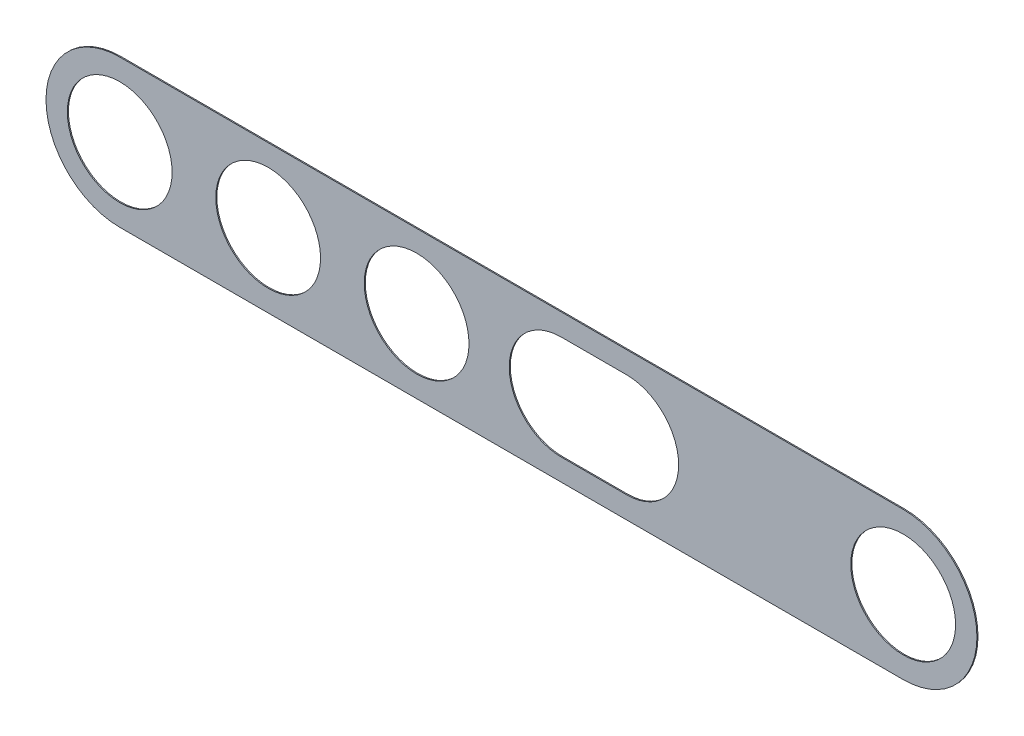
ISO-10303-21;
HEADER;
FILE_DESCRIPTION(('STEP AP214'),'2;1');
FILE_NAME('part.step','',(''),(''),'','','');
FILE_SCHEMA(('AUTOMOTIVE_DESIGN { 1 0 10303 214 1 1 1 1 }'));
ENDSEC;
DATA;
#1=APPLICATION_CONTEXT('core data for automotive mechanical design processes');
#2=APPLICATION_PROTOCOL_DEFINITION('international standard','automotive_design',2000,#1);
#3=PRODUCT_CONTEXT('',#1,'mechanical');
#4=PRODUCT('Part','Part','',(#3));
#5=PRODUCT_RELATED_PRODUCT_CATEGORY('part','',(#4));
#6=PRODUCT_DEFINITION_FORMATION('','',#4);
#7=PRODUCT_DEFINITION_CONTEXT('part definition',#1,'design');
#8=PRODUCT_DEFINITION('design','',#6,#7);
#9=PRODUCT_DEFINITION_SHAPE('','',#8);
#10=(LENGTH_UNIT() NAMED_UNIT(*) SI_UNIT(.MILLI.,.METRE.));
#11=(NAMED_UNIT(*) PLANE_ANGLE_UNIT() SI_UNIT($,.RADIAN.));
#12=(NAMED_UNIT(*) SI_UNIT($,.STERADIAN.) SOLID_ANGLE_UNIT());
#13=UNCERTAINTY_MEASURE_WITH_UNIT(LENGTH_MEASURE(1.E-05),#10,'distance_accuracy_value','');
#14=(GEOMETRIC_REPRESENTATION_CONTEXT(3) GLOBAL_UNCERTAINTY_ASSIGNED_CONTEXT((#13)) GLOBAL_UNIT_ASSIGNED_CONTEXT((#10,
#11,#12)) REPRESENTATION_CONTEXT('',''));
#15=CARTESIAN_POINT('',(0.,0.,0.));
#16=DIRECTION('',(0.,0.,1.));
#17=DIRECTION('',(1.,0.,0.));
#18=AXIS2_PLACEMENT_3D('',#15,#16,#17);
#19=CARTESIAN_POINT('',(13.96785551477,0.,-0.675));
#20=DIRECTION('',(0.,0.,1.));
#21=DIRECTION('',(1.,0.,0.));
#22=AXIS2_PLACEMENT_3D('',#19,#20,#21);
#23=CYLINDRICAL_SURFACE('',#22,6.3);
#24=DIRECTION('',(0.,0.,1.));
#25=VECTOR('',#24,1.);
#26=CARTESIAN_POINT('',(13.96785551477,6.3,-0.805));
#27=LINE('',#26,#25);
#28=CARTESIAN_POINT('',(13.96785551477,6.3,-0.805));
#29=VERTEX_POINT('',#28);
#30=CARTESIAN_POINT('',(13.96785551477,6.3,-0.675));
#31=VERTEX_POINT('',#30);
#32=EDGE_CURVE('E11',#29,#31,#27,.T.);
#33=ORIENTED_EDGE('',*,*,#32,.F.);
#34=CARTESIAN_POINT('',(13.96785551477,0.,-0.805));
#35=DIRECTION('',(0.,0.,-1.));
#36=DIRECTION('',(0.,1.,0.));
#37=AXIS2_PLACEMENT_3D('',#34,#35,#36);
#38=CIRCLE('',#37,6.3);
#39=CARTESIAN_POINT('',(20.26785551477,0.,-0.805));
#40=VERTEX_POINT('',#39);
#41=EDGE_CURVE('E237',#29,#40,#38,.T.);
#42=ORIENTED_EDGE('',*,*,#41,.T.);
#43=CARTESIAN_POINT('',(13.96785551477,0.,-0.805));
#44=DIRECTION('',(0.,0.,-1.));
#45=DIRECTION('',(1.,0.,0.));
#46=AXIS2_PLACEMENT_3D('',#43,#44,#45);
#47=CIRCLE('',#46,6.3);
#48=CARTESIAN_POINT('',(13.96785551477,-6.3,-0.805));
#49=VERTEX_POINT('',#48);
#50=EDGE_CURVE('E314',#40,#49,#47,.T.);
#51=ORIENTED_EDGE('',*,*,#50,.T.);
#52=DIRECTION('',(0.,0.,-1.));
#53=VECTOR('',#52,1.);
#54=CARTESIAN_POINT('',(13.96785551477,-6.3,-0.675));
#55=LINE('',#54,#53);
#56=CARTESIAN_POINT('',(13.96785551477,-6.3,-0.675));
#57=VERTEX_POINT('',#56);
#58=EDGE_CURVE('E296',#57,#49,#55,.T.);
#59=ORIENTED_EDGE('',*,*,#58,.F.);
#60=CARTESIAN_POINT('',(13.96785551477,0.,-0.675));
#61=DIRECTION('',(0.,0.,1.));
#62=DIRECTION('',(0.,-1.,0.));
#63=AXIS2_PLACEMENT_3D('',#60,#61,#62);
#64=CIRCLE('',#63,6.3);
#65=CARTESIAN_POINT('',(20.26785551477,0.,-0.675));
#66=VERTEX_POINT('',#65);
#67=EDGE_CURVE('E265',#57,#66,#64,.T.);
#68=ORIENTED_EDGE('',*,*,#67,.T.);
#69=CARTESIAN_POINT('',(13.96785551477,0.,-0.675));
#70=DIRECTION('',(0.,0.,1.));
#71=DIRECTION('',(1.,0.,0.));
#72=AXIS2_PLACEMENT_3D('',#69,#70,#71);
#73=CIRCLE('',#72,6.3);
#74=EDGE_CURVE('E262',#66,#31,#73,.T.);
#75=ORIENTED_EDGE('',*,*,#74,.T.);
#76=EDGE_LOOP('',(#33,#42,#51,#59,#68,#75));
#77=FACE_BOUND('',#76,.T.);
#78=ADVANCED_FACE('F17',(#77),#23,.F.);
#79=CARTESIAN_POINT('',(6.032144485231,6.3,-0.675));
#80=DIRECTION('',(0.,-1.,0.));
#81=DIRECTION('',(0.,0.,-1.));
#82=AXIS2_PLACEMENT_3D('',#79,#80,#81);
#83=PLANE('',#82);
#84=DIRECTION('',(0.,0.,-1.));
#85=VECTOR('',#84,1.);
#86=CARTESIAN_POINT('',(6.032144485231,6.3,-0.675));
#87=LINE('',#86,#85);
#88=CARTESIAN_POINT('',(6.032144485231,6.3,-0.675));
#89=VERTEX_POINT('',#88);
#90=CARTESIAN_POINT('',(6.032144485231,6.3,-0.805));
#91=VERTEX_POINT('',#90);
#92=EDGE_CURVE('E28',#89,#91,#87,.T.);
#93=ORIENTED_EDGE('',*,*,#92,.T.);
#94=DIRECTION('',(-1.,0.,0.));
#95=VECTOR('',#94,1.);
#96=CARTESIAN_POINT('',(13.96785551477,6.3,-0.805));
#97=LINE('',#96,#95);
#98=EDGE_CURVE('E244',#29,#91,#97,.T.);
#99=ORIENTED_EDGE('',*,*,#98,.F.);
#100=ORIENTED_EDGE('',*,*,#32,.T.);
#101=DIRECTION('',(-1.,0.,0.));
#102=VECTOR('',#101,1.);
#103=CARTESIAN_POINT('',(13.96785551477,6.3,-0.675));
#104=LINE('',#103,#102);
#105=EDGE_CURVE('E266',#31,#89,#104,.T.);
#106=ORIENTED_EDGE('',*,*,#105,.T.);
#107=EDGE_LOOP('',(#93,#99,#100,#106));
#108=FACE_BOUND('',#107,.T.);
#109=ADVANCED_FACE('F444',(#108),#83,.T.);
#110=CARTESIAN_POINT('',(6.032144485231,0.,-0.675));
#111=DIRECTION('',(0.,0.,1.));
#112=DIRECTION('',(1.,0.,0.));
#113=AXIS2_PLACEMENT_3D('',#110,#111,#112);
#114=CYLINDRICAL_SURFACE('',#113,6.3);
#115=DIRECTION('',(0.,0.,1.));
#116=VECTOR('',#115,1.);
#117=CARTESIAN_POINT('',(6.032144485231,-6.3,-0.805));
#118=LINE('',#117,#116);
#119=CARTESIAN_POINT('',(6.032144485231,-6.3,-0.805));
#120=VERTEX_POINT('',#119);
#121=CARTESIAN_POINT('',(6.032144485231,-6.3,-0.675));
#122=VERTEX_POINT('',#121);
#123=EDGE_CURVE('E42',#120,#122,#118,.T.);
#124=ORIENTED_EDGE('',*,*,#123,.F.);
#125=CARTESIAN_POINT('',(6.032144485231,0.,-0.805));
#126=DIRECTION('',(0.,0.,-1.));
#127=DIRECTION('',(0.,-1.,0.));
#128=AXIS2_PLACEMENT_3D('',#125,#126,#127);
#129=CIRCLE('',#128,6.3);
#130=CARTESIAN_POINT('',(-0.267855514769,0.,-0.805));
#131=VERTEX_POINT('',#130);
#132=EDGE_CURVE('E289',#120,#131,#129,.T.);
#133=ORIENTED_EDGE('',*,*,#132,.T.);
#134=CARTESIAN_POINT('',(6.032144485231,0.,-0.805));
#135=DIRECTION('',(0.,0.,-1.));
#136=DIRECTION('',(-1.,0.,0.));
#137=AXIS2_PLACEMENT_3D('',#134,#135,#136);
#138=CIRCLE('',#137,6.3);
#139=EDGE_CURVE('E21',#131,#91,#138,.T.);
#140=ORIENTED_EDGE('',*,*,#139,.T.);
#141=ORIENTED_EDGE('',*,*,#92,.F.);
#142=CARTESIAN_POINT('',(6.032144485231,0.,-0.675));
#143=DIRECTION('',(0.,0.,1.));
#144=DIRECTION('',(0.,1.,0.));
#145=AXIS2_PLACEMENT_3D('',#142,#143,#144);
#146=CIRCLE('',#145,6.3);
#147=CARTESIAN_POINT('',(-0.267855514769,0.,-0.675));
#148=VERTEX_POINT('',#147);
#149=EDGE_CURVE('E165',#89,#148,#146,.T.);
#150=ORIENTED_EDGE('',*,*,#149,.T.);
#151=CARTESIAN_POINT('',(6.032144485231,0.,-0.675));
#152=DIRECTION('',(0.,0.,1.));
#153=DIRECTION('',(-1.,0.,0.));
#154=AXIS2_PLACEMENT_3D('',#151,#152,#153);
#155=CIRCLE('',#154,6.3);
#156=EDGE_CURVE('E319',#148,#122,#155,.T.);
#157=ORIENTED_EDGE('',*,*,#156,.T.);
#158=EDGE_LOOP('',(#124,#133,#140,#141,#150,#157));
#159=FACE_BOUND('',#158,.T.);
#160=ADVANCED_FACE('F450',(#159),#114,.F.);
#161=CARTESIAN_POINT('',(13.96785551477,-6.3,-0.675));
#162=DIRECTION('',(0.,1.,0.));
#163=DIRECTION('',(1.,0.,0.));
#164=AXIS2_PLACEMENT_3D('',#161,#162,#163);
#165=PLANE('',#164);
#166=ORIENTED_EDGE('',*,*,#58,.T.);
#167=DIRECTION('',(1.,0.,0.));
#168=VECTOR('',#167,1.);
#169=CARTESIAN_POINT('',(6.032144485231,-6.3,-0.805));
#170=LINE('',#169,#168);
#171=EDGE_CURVE('E279',#120,#49,#170,.T.);
#172=ORIENTED_EDGE('',*,*,#171,.F.);
#173=ORIENTED_EDGE('',*,*,#123,.T.);
#174=DIRECTION('',(1.,0.,0.));
#175=VECTOR('',#174,1.);
#176=CARTESIAN_POINT('',(6.032144485231,-6.3,-0.675));
#177=LINE('',#176,#175);
#178=EDGE_CURVE('E380',#122,#57,#177,.T.);
#179=ORIENTED_EDGE('',*,*,#178,.T.);
#180=EDGE_LOOP('',(#166,#172,#173,#179));
#181=FACE_BOUND('',#180,.T.);
#182=ADVANCED_FACE('F19',(#181),#165,.T.);
#183=CARTESIAN_POINT('',(47.5,0.,-0.675));
#184=DIRECTION('',(0.,0.,1.));
#185=DIRECTION('',(1.,0.,0.));
#186=AXIS2_PLACEMENT_3D('',#183,#184,#185);
#187=CYLINDRICAL_SURFACE('',#186,6.35);
#188=DIRECTION('',(0.,0.,1.));
#189=VECTOR('',#188,1.);
#190=CARTESIAN_POINT('',(41.15,0.,-0.805));
#191=LINE('',#190,#189);
#192=CARTESIAN_POINT('',(41.15,0.,-0.805));
#193=VERTEX_POINT('',#192);
#194=CARTESIAN_POINT('',(41.15,0.,-0.675));
#195=VERTEX_POINT('',#194);
#196=EDGE_CURVE('E294',#193,#195,#191,.T.);
#197=ORIENTED_EDGE('',*,*,#196,.F.);
#198=CARTESIAN_POINT('',(47.5,0.,-0.805));
#199=DIRECTION('',(0.,0.,-1.));
#200=DIRECTION('',(-1.,0.,0.));
#201=AXIS2_PLACEMENT_3D('',#198,#199,#200);
#202=CIRCLE('',#201,6.35);
#203=CARTESIAN_POINT('',(53.85,0.,-0.805));
#204=VERTEX_POINT('',#203);
#205=EDGE_CURVE('E328',#193,#204,#202,.T.);
#206=ORIENTED_EDGE('',*,*,#205,.T.);
#207=DIRECTION('',(0.,0.,1.));
#208=VECTOR('',#207,1.);
#209=CARTESIAN_POINT('',(53.85,0.,-0.805));
#210=LINE('',#209,#208);
#211=CARTESIAN_POINT('',(53.85,0.,-0.675));
#212=VERTEX_POINT('',#211);
#213=EDGE_CURVE('E214',#204,#212,#210,.T.);
#214=ORIENTED_EDGE('',*,*,#213,.T.);
#215=CARTESIAN_POINT('',(47.5,0.,-0.675));
#216=DIRECTION('',(0.,0.,1.));
#217=DIRECTION('',(1.,0.,0.));
#218=AXIS2_PLACEMENT_3D('',#215,#216,#217);
#219=CIRCLE('',#218,6.35);
#220=EDGE_CURVE('E222',#212,#195,#219,.T.);
#221=ORIENTED_EDGE('',*,*,#220,.T.);
#222=EDGE_LOOP('',(#197,#206,#214,#221));
#223=FACE_BOUND('',#222,.T.);
#224=ADVANCED_FACE('F492',(#223),#187,.F.);
#225=CARTESIAN_POINT('',(47.5,0.,-0.675));
#226=DIRECTION('',(0.,0.,1.));
#227=DIRECTION('',(1.,0.,0.));
#228=AXIS2_PLACEMENT_3D('',#225,#226,#227);
#229=CYLINDRICAL_SURFACE('',#228,6.35);
#230=ORIENTED_EDGE('',*,*,#213,.F.);
#231=CARTESIAN_POINT('',(47.5,0.,-0.805));
#232=DIRECTION('',(0.,0.,-1.));
#233=DIRECTION('',(1.,0.,0.));
#234=AXIS2_PLACEMENT_3D('',#231,#232,#233);
#235=CIRCLE('',#234,6.35);
#236=EDGE_CURVE('E317',#204,#193,#235,.T.);
#237=ORIENTED_EDGE('',*,*,#236,.T.);
#238=ORIENTED_EDGE('',*,*,#196,.T.);
#239=CARTESIAN_POINT('',(47.5,0.,-0.675));
#240=DIRECTION('',(0.,0.,1.));
#241=DIRECTION('',(-1.,0.,0.));
#242=AXIS2_PLACEMENT_3D('',#239,#240,#241);
#243=CIRCLE('',#242,6.35);
#244=EDGE_CURVE('E322',#195,#212,#243,.T.);
#245=ORIENTED_EDGE('',*,*,#244,.T.);
#246=EDGE_LOOP('',(#230,#237,#238,#245));
#247=FACE_BOUND('',#246,.T.);
#248=ADVANCED_FACE('F490',(#247),#229,.F.);
#249=CARTESIAN_POINT('',(-47.5,0.,-0.675));
#250=DIRECTION('',(0.,0.,1.));
#251=DIRECTION('',(1.,0.,0.));
#252=AXIS2_PLACEMENT_3D('',#249,#250,#251);
#253=CYLINDRICAL_SURFACE('',#252,6.35);
#254=DIRECTION('',(0.,0.,1.));
#255=VECTOR('',#254,1.);
#256=CARTESIAN_POINT('',(-53.85,0.,-0.805));
#257=LINE('',#256,#255);
#258=CARTESIAN_POINT('',(-53.85,0.,-0.805));
#259=VERTEX_POINT('',#258);
#260=CARTESIAN_POINT('',(-53.85,0.,-0.675));
#261=VERTEX_POINT('',#260);
#262=EDGE_CURVE('E202',#259,#261,#257,.T.);
#263=ORIENTED_EDGE('',*,*,#262,.F.);
#264=CARTESIAN_POINT('',(-47.5,0.,-0.805));
#265=DIRECTION('',(0.,0.,-1.));
#266=DIRECTION('',(-1.,0.,0.));
#267=AXIS2_PLACEMENT_3D('',#264,#265,#266);
#268=CIRCLE('',#267,6.35);
#269=CARTESIAN_POINT('',(-41.15,0.,-0.805));
#270=VERTEX_POINT('',#269);
#271=EDGE_CURVE('E302',#259,#270,#268,.T.);
#272=ORIENTED_EDGE('',*,*,#271,.T.);
#273=DIRECTION('',(0.,0.,1.));
#274=VECTOR('',#273,1.);
#275=CARTESIAN_POINT('',(-41.15,0.,-0.805));
#276=LINE('',#275,#274);
#277=CARTESIAN_POINT('',(-41.15,0.,-0.675));
#278=VERTEX_POINT('',#277);
#279=EDGE_CURVE('E215',#270,#278,#276,.T.);
#280=ORIENTED_EDGE('',*,*,#279,.T.);
#281=CARTESIAN_POINT('',(-47.5,0.,-0.675));
#282=DIRECTION('',(0.,0.,1.));
#283=DIRECTION('',(1.,0.,0.));
#284=AXIS2_PLACEMENT_3D('',#281,#282,#283);
#285=CIRCLE('',#284,6.35);
#286=EDGE_CURVE('E220',#278,#261,#285,.T.);
#287=ORIENTED_EDGE('',*,*,#286,.T.);
#288=EDGE_LOOP('',(#263,#272,#280,#287));
#289=FACE_BOUND('',#288,.T.);
#290=ADVANCED_FACE('F224',(#289),#253,.F.);
#291=CARTESIAN_POINT('',(-47.5,0.,-0.675));
#292=DIRECTION('',(0.,0.,1.));
#293=DIRECTION('',(1.,0.,0.));
#294=AXIS2_PLACEMENT_3D('',#291,#292,#293);
#295=CYLINDRICAL_SURFACE('',#294,6.35);
#296=ORIENTED_EDGE('',*,*,#279,.F.);
#297=CARTESIAN_POINT('',(-47.5,0.,-0.805));
#298=DIRECTION('',(0.,0.,-1.));
#299=DIRECTION('',(1.,0.,0.));
#300=AXIS2_PLACEMENT_3D('',#297,#298,#299);
#301=CIRCLE('',#300,6.35);
#302=EDGE_CURVE('E208',#270,#259,#301,.T.);
#303=ORIENTED_EDGE('',*,*,#302,.T.);
#304=ORIENTED_EDGE('',*,*,#262,.T.);
#305=CARTESIAN_POINT('',(-47.5,0.,-0.675));
#306=DIRECTION('',(0.,0.,1.));
#307=DIRECTION('',(-1.,0.,0.));
#308=AXIS2_PLACEMENT_3D('',#305,#306,#307);
#309=CIRCLE('',#308,6.35);
#310=EDGE_CURVE('E205',#261,#278,#309,.T.);
#311=ORIENTED_EDGE('',*,*,#310,.T.);
#312=EDGE_LOOP('',(#296,#303,#304,#311));
#313=FACE_BOUND('',#312,.T.);
#314=ADVANCED_FACE('F204',(#313),#295,.F.);
#315=CARTESIAN_POINT('',(-29.5,0.,-0.675));
#316=DIRECTION('',(0.,0.,1.));
#317=DIRECTION('',(1.,0.,0.));
#318=AXIS2_PLACEMENT_3D('',#315,#316,#317);
#319=CYLINDRICAL_SURFACE('',#318,6.35);
#320=DIRECTION('',(0.,0.,1.));
#321=VECTOR('',#320,1.);
#322=CARTESIAN_POINT('',(-35.85,0.,-0.805));
#323=LINE('',#322,#321);
#324=CARTESIAN_POINT('',(-35.85,0.,-0.805));
#325=VERTEX_POINT('',#324);
#326=CARTESIAN_POINT('',(-35.85,0.,-0.675));
#327=VERTEX_POINT('',#326);
#328=EDGE_CURVE('E258',#325,#327,#323,.T.);
#329=ORIENTED_EDGE('',*,*,#328,.F.);
#330=CARTESIAN_POINT('',(-29.5,0.,-0.805));
#331=DIRECTION('',(0.,0.,-1.));
#332=DIRECTION('',(-1.,0.,0.));
#333=AXIS2_PLACEMENT_3D('',#330,#331,#332);
#334=CIRCLE('',#333,6.35);
#335=CARTESIAN_POINT('',(-23.15,0.,-0.805));
#336=VERTEX_POINT('',#335);
#337=EDGE_CURVE('E369',#325,#336,#334,.T.);
#338=ORIENTED_EDGE('',*,*,#337,.T.);
#339=DIRECTION('',(0.,0.,1.));
#340=VECTOR('',#339,1.);
#341=CARTESIAN_POINT('',(-23.15,0.,-0.805));
#342=LINE('',#341,#340);
#343=CARTESIAN_POINT('',(-23.15,0.,-0.675));
#344=VERTEX_POINT('',#343);
#345=EDGE_CURVE('E261',#336,#344,#342,.T.);
#346=ORIENTED_EDGE('',*,*,#345,.T.);
#347=CARTESIAN_POINT('',(-29.5,0.,-0.675));
#348=DIRECTION('',(0.,0.,1.));
#349=DIRECTION('',(1.,0.,0.));
#350=AXIS2_PLACEMENT_3D('',#347,#348,#349);
#351=CIRCLE('',#350,6.35);
#352=EDGE_CURVE('E233',#344,#327,#351,.T.);
#353=ORIENTED_EDGE('',*,*,#352,.T.);
#354=EDGE_LOOP('',(#329,#338,#346,#353));
#355=FACE_BOUND('',#354,.T.);
#356=ADVANCED_FACE('F458',(#355),#319,.F.);
#357=CARTESIAN_POINT('',(-29.5,0.,-0.675));
#358=DIRECTION('',(0.,0.,1.));
#359=DIRECTION('',(1.,0.,0.));
#360=AXIS2_PLACEMENT_3D('',#357,#358,#359);
#361=CYLINDRICAL_SURFACE('',#360,6.35);
#362=ORIENTED_EDGE('',*,*,#345,.F.);
#363=CARTESIAN_POINT('',(-29.5,0.,-0.805));
#364=DIRECTION('',(0.,0.,-1.));
#365=DIRECTION('',(1.,0.,0.));
#366=AXIS2_PLACEMENT_3D('',#363,#364,#365);
#367=CIRCLE('',#366,6.35);
#368=EDGE_CURVE('E305',#336,#325,#367,.T.);
#369=ORIENTED_EDGE('',*,*,#368,.T.);
#370=ORIENTED_EDGE('',*,*,#328,.T.);
#371=CARTESIAN_POINT('',(-29.5,0.,-0.675));
#372=DIRECTION('',(0.,0.,1.));
#373=DIRECTION('',(-1.,0.,0.));
#374=AXIS2_PLACEMENT_3D('',#371,#372,#373);
#375=CIRCLE('',#374,6.35);
#376=EDGE_CURVE('E226',#327,#344,#375,.T.);
#377=ORIENTED_EDGE('',*,*,#376,.T.);
#378=EDGE_LOOP('',(#362,#369,#370,#377));
#379=FACE_BOUND('',#378,.T.);
#380=ADVANCED_FACE('F461',(#379),#361,.F.);
#381=CARTESIAN_POINT('',(-11.5,0.,-0.675));
#382=DIRECTION('',(0.,0.,1.));
#383=DIRECTION('',(1.,0.,0.));
#384=AXIS2_PLACEMENT_3D('',#381,#382,#383);
#385=CYLINDRICAL_SURFACE('',#384,6.35);
#386=DIRECTION('',(0.,0.,1.));
#387=VECTOR('',#386,1.);
#388=CARTESIAN_POINT('',(-17.85,0.,-0.805));
#389=LINE('',#388,#387);
#390=CARTESIAN_POINT('',(-17.85,0.,-0.805));
#391=VERTEX_POINT('',#390);
#392=CARTESIAN_POINT('',(-17.85,0.,-0.675));
#393=VERTEX_POINT('',#392);
#394=EDGE_CURVE('E267',#391,#393,#389,.T.);
#395=ORIENTED_EDGE('',*,*,#394,.F.);
#396=CARTESIAN_POINT('',(-11.5,0.,-0.805));
#397=DIRECTION('',(0.,0.,-1.));
#398=DIRECTION('',(-1.,0.,0.));
#399=AXIS2_PLACEMENT_3D('',#396,#397,#398);
#400=CIRCLE('',#399,6.35);
#401=CARTESIAN_POINT('',(-5.15,0.,-0.805));
#402=VERTEX_POINT('',#401);
#403=EDGE_CURVE('E375',#391,#402,#400,.T.);
#404=ORIENTED_EDGE('',*,*,#403,.T.);
#405=DIRECTION('',(0.,0.,1.));
#406=VECTOR('',#405,1.);
#407=CARTESIAN_POINT('',(-5.15,0.,-0.805));
#408=LINE('',#407,#406);
#409=CARTESIAN_POINT('',(-5.15,0.,-0.675));
#410=VERTEX_POINT('',#409);
#411=EDGE_CURVE('E269',#402,#410,#408,.T.);
#412=ORIENTED_EDGE('',*,*,#411,.T.);
#413=CARTESIAN_POINT('',(-11.5,0.,-0.675));
#414=DIRECTION('',(0.,0.,1.));
#415=DIRECTION('',(1.,0.,0.));
#416=AXIS2_PLACEMENT_3D('',#413,#414,#415);
#417=CIRCLE('',#416,6.35);
#418=EDGE_CURVE('E251',#410,#393,#417,.T.);
#419=ORIENTED_EDGE('',*,*,#418,.T.);
#420=EDGE_LOOP('',(#395,#404,#412,#419));
#421=FACE_BOUND('',#420,.T.);
#422=ADVANCED_FACE('F466',(#421),#385,.F.);
#423=CARTESIAN_POINT('',(-11.5,0.,-0.675));
#424=DIRECTION('',(0.,0.,1.));
#425=DIRECTION('',(1.,0.,0.));
#426=AXIS2_PLACEMENT_3D('',#423,#424,#425);
#427=CYLINDRICAL_SURFACE('',#426,6.35);
#428=ORIENTED_EDGE('',*,*,#411,.F.);
#429=CARTESIAN_POINT('',(-11.5,0.,-0.805));
#430=DIRECTION('',(0.,0.,-1.));
#431=DIRECTION('',(1.,0.,0.));
#432=AXIS2_PLACEMENT_3D('',#429,#430,#431);
#433=CIRCLE('',#432,6.35);
#434=EDGE_CURVE('E373',#402,#391,#433,.T.);
#435=ORIENTED_EDGE('',*,*,#434,.T.);
#436=ORIENTED_EDGE('',*,*,#394,.T.);
#437=CARTESIAN_POINT('',(-11.5,0.,-0.675));
#438=DIRECTION('',(0.,0.,1.));
#439=DIRECTION('',(-1.,0.,0.));
#440=AXIS2_PLACEMENT_3D('',#437,#438,#439);
#441=CIRCLE('',#440,6.35);
#442=EDGE_CURVE('E368',#393,#410,#441,.T.);
#443=ORIENTED_EDGE('',*,*,#442,.T.);
#444=EDGE_LOOP('',(#428,#435,#436,#443));
#445=FACE_BOUND('',#444,.T.);
#446=ADVANCED_FACE('F477',(#445),#427,.F.);
#447=CARTESIAN_POINT('',(0.,0.,-0.805));
#448=DIRECTION('',(0.,0.,1.));
#449=DIRECTION('',(1.,0.,0.));
#450=AXIS2_PLACEMENT_3D('',#447,#448,#449);
#451=PLANE('',#450);
#452=ORIENTED_EDGE('',*,*,#50,.F.);
#453=ORIENTED_EDGE('',*,*,#41,.F.);
#454=ORIENTED_EDGE('',*,*,#98,.T.);
#455=ORIENTED_EDGE('',*,*,#139,.F.);
#456=ORIENTED_EDGE('',*,*,#132,.F.);
#457=ORIENTED_EDGE('',*,*,#171,.T.);
#458=EDGE_LOOP('',(#452,#453,#454,#455,#456,#457));
#459=FACE_BOUND('',#458,.T.);
#460=ORIENTED_EDGE('',*,*,#205,.F.);
#461=ORIENTED_EDGE('',*,*,#236,.F.);
#462=EDGE_LOOP('',(#460,#461));
#463=FACE_BOUND('',#462,.T.);
#464=ORIENTED_EDGE('',*,*,#271,.F.);
#465=ORIENTED_EDGE('',*,*,#302,.F.);
#466=EDGE_LOOP('',(#464,#465));
#467=FACE_BOUND('',#466,.T.);
#468=ORIENTED_EDGE('',*,*,#337,.F.);
#469=ORIENTED_EDGE('',*,*,#368,.F.);
#470=EDGE_LOOP('',(#468,#469));
#471=FACE_BOUND('',#470,.T.);
#472=ORIENTED_EDGE('',*,*,#403,.F.);
#473=ORIENTED_EDGE('',*,*,#434,.F.);
#474=EDGE_LOOP('',(#472,#473));
#475=FACE_BOUND('',#474,.T.);
#476=DIRECTION('',(1.,0.,0.));
#477=VECTOR('',#476,1.);
#478=CARTESIAN_POINT('',(-47.5,8.94,-0.805));
#479=LINE('',#478,#477);
#480=CARTESIAN_POINT('',(-47.5,8.94,-0.805));
#481=VERTEX_POINT('',#480);
#482=CARTESIAN_POINT('',(47.5,8.94,-0.805));
#483=VERTEX_POINT('',#482);
#484=EDGE_CURVE('E310',#481,#483,#479,.T.);
#485=ORIENTED_EDGE('',*,*,#484,.T.);
#486=CARTESIAN_POINT('',(47.5,0.,-0.805));
#487=DIRECTION('',(0.,0.,1.));
#488=DIRECTION('',(1.,0.,0.));
#489=AXIS2_PLACEMENT_3D('',#486,#487,#488);
#490=CIRCLE('',#489,8.94);
#491=CARTESIAN_POINT('',(56.44,0.,-0.805));
#492=VERTEX_POINT('',#491);
#493=EDGE_CURVE('E311',#492,#483,#490,.T.);
#494=ORIENTED_EDGE('',*,*,#493,.F.);
#495=CARTESIAN_POINT('',(47.5,0.,-0.805));
#496=DIRECTION('',(0.,0.,1.));
#497=DIRECTION('',(0.,-1.,0.));
#498=AXIS2_PLACEMENT_3D('',#495,#496,#497);
#499=CIRCLE('',#498,8.94);
#500=CARTESIAN_POINT('',(47.5,-8.94,-0.805));
#501=VERTEX_POINT('',#500);
#502=EDGE_CURVE('E329',#501,#492,#499,.T.);
#503=ORIENTED_EDGE('',*,*,#502,.F.);
#504=DIRECTION('',(-1.,0.,0.));
#505=VECTOR('',#504,1.);
#506=CARTESIAN_POINT('',(47.5,-8.94,-0.805));
#507=LINE('',#506,#505);
#508=CARTESIAN_POINT('',(-47.5,-8.94,-0.805));
#509=VERTEX_POINT('',#508);
#510=EDGE_CURVE('E242',#501,#509,#507,.T.);
#511=ORIENTED_EDGE('',*,*,#510,.T.);
#512=CARTESIAN_POINT('',(-47.5,0.,-0.805));
#513=DIRECTION('',(0.,0.,1.));
#514=DIRECTION('',(-1.,0.,0.));
#515=AXIS2_PLACEMENT_3D('',#512,#513,#514);
#516=CIRCLE('',#515,8.94);
#517=CARTESIAN_POINT('',(-56.44,0.,-0.805));
#518=VERTEX_POINT('',#517);
#519=EDGE_CURVE('E243',#518,#509,#516,.T.);
#520=ORIENTED_EDGE('',*,*,#519,.F.);
#521=CARTESIAN_POINT('',(-47.5,0.,-0.805));
#522=DIRECTION('',(0.,0.,1.));
#523=DIRECTION('',(0.,1.,0.));
#524=AXIS2_PLACEMENT_3D('',#521,#522,#523);
#525=CIRCLE('',#524,8.94);
#526=EDGE_CURVE('E253',#481,#518,#525,.T.);
#527=ORIENTED_EDGE('',*,*,#526,.F.);
#528=EDGE_LOOP('',(#485,#494,#503,#511,#520,#527));
#529=FACE_BOUND('',#528,.T.);
#530=ADVANCED_FACE('F409',(#459,#463,#467,#471,#475,#529),#451,.F.);
#531=CARTESIAN_POINT('',(47.5,8.94,-0.675));
#532=DIRECTION('',(0.,1.,0.));
#533=DIRECTION('',(1.,0.,0.));
#534=AXIS2_PLACEMENT_3D('',#531,#532,#533);
#535=PLANE('',#534);
#536=DIRECTION('',(0.,0.,-1.));
#537=VECTOR('',#536,1.);
#538=CARTESIAN_POINT('',(47.5,8.94,-0.675));
#539=LINE('',#538,#537);
#540=CARTESIAN_POINT('',(47.5,8.94,-0.675));
#541=VERTEX_POINT('',#540);
#542=EDGE_CURVE('E306',#541,#483,#539,.T.);
#543=ORIENTED_EDGE('',*,*,#542,.T.);
#544=ORIENTED_EDGE('',*,*,#484,.F.);
#545=DIRECTION('',(0.,0.,1.));
#546=VECTOR('',#545,1.);
#547=CARTESIAN_POINT('',(-47.5,8.94,-0.805));
#548=LINE('',#547,#546);
#549=CARTESIAN_POINT('',(-47.5,8.94,-0.675));
#550=VERTEX_POINT('',#549);
#551=EDGE_CURVE('E257',#481,#550,#548,.T.);
#552=ORIENTED_EDGE('',*,*,#551,.T.);
#553=DIRECTION('',(1.,0.,0.));
#554=VECTOR('',#553,1.);
#555=CARTESIAN_POINT('',(-47.5,8.94,-0.675));
#556=LINE('',#555,#554);
#557=EDGE_CURVE('E297',#550,#541,#556,.T.);
#558=ORIENTED_EDGE('',*,*,#557,.T.);
#559=EDGE_LOOP('',(#543,#544,#552,#558));
#560=FACE_BOUND('',#559,.T.);
#561=ADVANCED_FACE('F412',(#560),#535,.T.);
#562=CARTESIAN_POINT('',(47.5,0.,-0.675));
#563=DIRECTION('',(0.,0.,1.));
#564=DIRECTION('',(1.,0.,0.));
#565=AXIS2_PLACEMENT_3D('',#562,#563,#564);
#566=CYLINDRICAL_SURFACE('',#565,8.94);
#567=DIRECTION('',(0.,0.,1.));
#568=VECTOR('',#567,1.);
#569=CARTESIAN_POINT('',(47.5,-8.94,-0.805));
#570=LINE('',#569,#568);
#571=CARTESIAN_POINT('',(47.5,-8.94,-0.675));
#572=VERTEX_POINT('',#571);
#573=EDGE_CURVE('E333',#501,#572,#570,.T.);
#574=ORIENTED_EDGE('',*,*,#573,.F.);
#575=ORIENTED_EDGE('',*,*,#502,.T.);
#576=ORIENTED_EDGE('',*,*,#493,.T.);
#577=ORIENTED_EDGE('',*,*,#542,.F.);
#578=CARTESIAN_POINT('',(47.5,0.,-0.675));
#579=DIRECTION('',(0.,0.,-1.));
#580=DIRECTION('',(0.,1.,0.));
#581=AXIS2_PLACEMENT_3D('',#578,#579,#580);
#582=CIRCLE('',#581,8.94);
#583=CARTESIAN_POINT('',(56.44,0.,-0.675));
#584=VERTEX_POINT('',#583);
#585=EDGE_CURVE('E301',#541,#584,#582,.T.);
#586=ORIENTED_EDGE('',*,*,#585,.T.);
#587=CARTESIAN_POINT('',(47.5,0.,-0.675));
#588=DIRECTION('',(0.,0.,-1.));
#589=DIRECTION('',(1.,0.,0.));
#590=AXIS2_PLACEMENT_3D('',#587,#588,#589);
#591=CIRCLE('',#590,8.94);
#592=EDGE_CURVE('E353',#584,#572,#591,.T.);
#593=ORIENTED_EDGE('',*,*,#592,.T.);
#594=EDGE_LOOP('',(#574,#575,#576,#577,#586,#593));
#595=FACE_BOUND('',#594,.T.);
#596=ADVANCED_FACE('F417',(#595),#566,.T.);
#597=CARTESIAN_POINT('',(-47.5,-8.94,-0.675));
#598=DIRECTION('',(0.,-1.,0.));
#599=DIRECTION('',(0.,0.,-1.));
#600=AXIS2_PLACEMENT_3D('',#597,#598,#599);
#601=PLANE('',#600);
#602=DIRECTION('',(0.,0.,-1.));
#603=VECTOR('',#602,1.);
#604=CARTESIAN_POINT('',(-47.5,-8.94,-0.675));
#605=LINE('',#604,#603);
#606=CARTESIAN_POINT('',(-47.5,-8.94,-0.675));
#607=VERTEX_POINT('',#606);
#608=EDGE_CURVE('E239',#607,#509,#605,.T.);
#609=ORIENTED_EDGE('',*,*,#608,.T.);
#610=ORIENTED_EDGE('',*,*,#510,.F.);
#611=ORIENTED_EDGE('',*,*,#573,.T.);
#612=DIRECTION('',(-1.,0.,0.));
#613=VECTOR('',#612,1.);
#614=CARTESIAN_POINT('',(47.5,-8.94,-0.675));
#615=LINE('',#614,#613);
#616=EDGE_CURVE('E293',#572,#607,#615,.T.);
#617=ORIENTED_EDGE('',*,*,#616,.T.);
#618=EDGE_LOOP('',(#609,#610,#611,#617));
#619=FACE_BOUND('',#618,.T.);
#620=ADVANCED_FACE('F421',(#619),#601,.T.);
#621=CARTESIAN_POINT('',(-47.5,0.,-0.675));
#622=DIRECTION('',(0.,0.,1.));
#623=DIRECTION('',(1.,0.,0.));
#624=AXIS2_PLACEMENT_3D('',#621,#622,#623);
#625=CYLINDRICAL_SURFACE('',#624,8.94);
#626=ORIENTED_EDGE('',*,*,#551,.F.);
#627=ORIENTED_EDGE('',*,*,#526,.T.);
#628=ORIENTED_EDGE('',*,*,#519,.T.);
#629=ORIENTED_EDGE('',*,*,#608,.F.);
#630=CARTESIAN_POINT('',(-47.5,0.,-0.675));
#631=DIRECTION('',(0.,0.,-1.));
#632=DIRECTION('',(0.,-1.,0.));
#633=AXIS2_PLACEMENT_3D('',#630,#631,#632);
#634=CIRCLE('',#633,8.94);
#635=CARTESIAN_POINT('',(-56.44,0.,-0.675));
#636=VERTEX_POINT('',#635);
#637=EDGE_CURVE('E248',#607,#636,#634,.T.);
#638=ORIENTED_EDGE('',*,*,#637,.T.);
#639=CARTESIAN_POINT('',(-47.5,0.,-0.675));
#640=DIRECTION('',(0.,0.,-1.));
#641=DIRECTION('',(-1.,0.,0.));
#642=AXIS2_PLACEMENT_3D('',#639,#640,#641);
#643=CIRCLE('',#642,8.94);
#644=EDGE_CURVE('E252',#636,#550,#643,.T.);
#645=ORIENTED_EDGE('',*,*,#644,.T.);
#646=EDGE_LOOP('',(#626,#627,#628,#629,#638,#645));
#647=FACE_BOUND('',#646,.T.);
#648=ADVANCED_FACE('F425',(#647),#625,.T.);
#649=CARTESIAN_POINT('',(0.,0.,-0.675));
#650=DIRECTION('',(0.,0.,1.));
#651=DIRECTION('',(1.,0.,0.));
#652=AXIS2_PLACEMENT_3D('',#649,#650,#651);
#653=PLANE('',#652);
#654=ORIENTED_EDGE('',*,*,#156,.F.);
#655=ORIENTED_EDGE('',*,*,#149,.F.);
#656=ORIENTED_EDGE('',*,*,#105,.F.);
#657=ORIENTED_EDGE('',*,*,#74,.F.);
#658=ORIENTED_EDGE('',*,*,#67,.F.);
#659=ORIENTED_EDGE('',*,*,#178,.F.);
#660=EDGE_LOOP('',(#654,#655,#656,#657,#658,#659));
#661=FACE_BOUND('',#660,.T.);
#662=ORIENTED_EDGE('',*,*,#220,.F.);
#663=ORIENTED_EDGE('',*,*,#244,.F.);
#664=EDGE_LOOP('',(#662,#663));
#665=FACE_BOUND('',#664,.T.);
#666=ORIENTED_EDGE('',*,*,#286,.F.);
#667=ORIENTED_EDGE('',*,*,#310,.F.);
#668=EDGE_LOOP('',(#666,#667));
#669=FACE_BOUND('',#668,.T.);
#670=ORIENTED_EDGE('',*,*,#352,.F.);
#671=ORIENTED_EDGE('',*,*,#376,.F.);
#672=EDGE_LOOP('',(#670,#671));
#673=FACE_BOUND('',#672,.T.);
#674=ORIENTED_EDGE('',*,*,#418,.F.);
#675=ORIENTED_EDGE('',*,*,#442,.F.);
#676=EDGE_LOOP('',(#674,#675));
#677=FACE_BOUND('',#676,.T.);
#678=ORIENTED_EDGE('',*,*,#616,.F.);
#679=ORIENTED_EDGE('',*,*,#592,.F.);
#680=ORIENTED_EDGE('',*,*,#585,.F.);
#681=ORIENTED_EDGE('',*,*,#557,.F.);
#682=ORIENTED_EDGE('',*,*,#644,.F.);
#683=ORIENTED_EDGE('',*,*,#637,.F.);
#684=EDGE_LOOP('',(#678,#679,#680,#681,#682,#683));
#685=FACE_BOUND('',#684,.T.);
#686=ADVANCED_FACE('F218',(#661,#665,#669,#673,#677,#685),#653,.T.);
#687=CLOSED_SHELL('',(#78,#109,#160,#182,#224,#248,#290,#314,#356,#380,#422,#446,#530,#561,#596,
#620,#648,#686));
#688=MANIFOLD_SOLID_BREP('B1',#687);
#689=ADVANCED_BREP_SHAPE_REPRESENTATION('',(#18,#688),#14);
#690=SHAPE_DEFINITION_REPRESENTATION(#9,#689);
ENDSEC;
END-ISO-10303-21;
